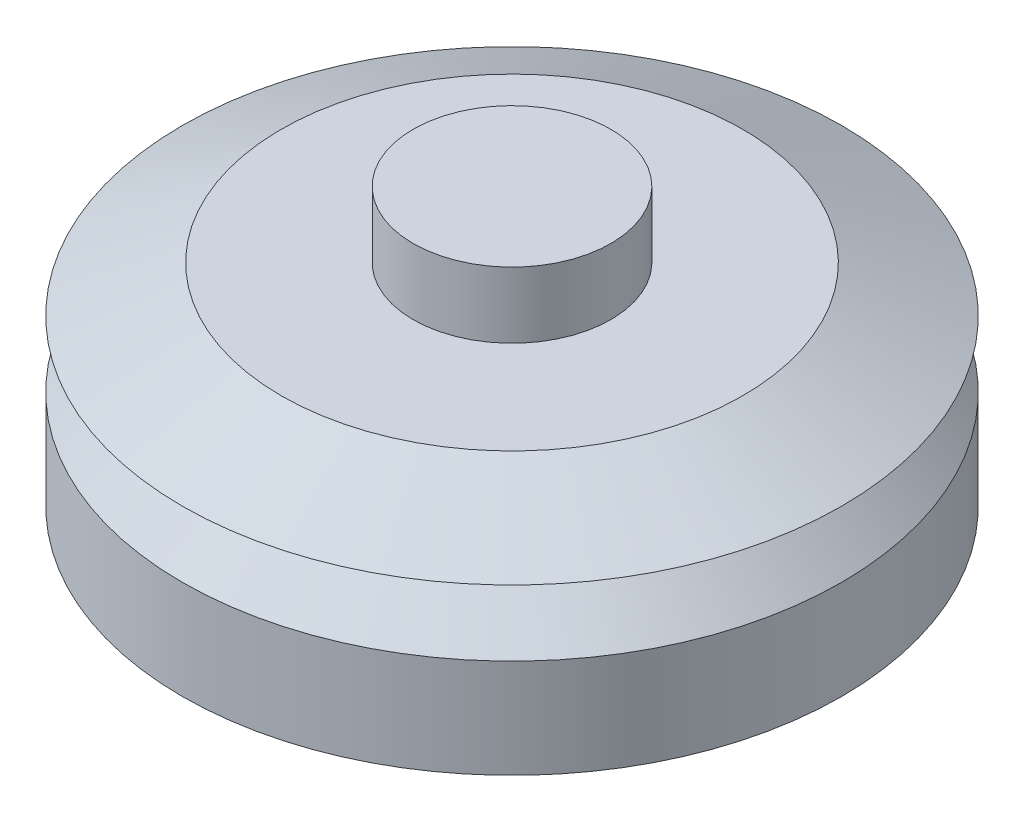
ISO-10303-21;
HEADER;
FILE_DESCRIPTION(('STEP AP214'),'2;1');
FILE_NAME('part.step','',(''),(''),'','','');
FILE_SCHEMA(('AUTOMOTIVE_DESIGN { 1 0 10303 214 1 1 1 1 }'));
ENDSEC;
DATA;
#1=APPLICATION_CONTEXT('core data for automotive mechanical design processes');
#2=APPLICATION_PROTOCOL_DEFINITION('international standard','automotive_design',2000,#1);
#3=PRODUCT_CONTEXT('',#1,'mechanical');
#4=PRODUCT('Part','Part','',(#3));
#5=PRODUCT_RELATED_PRODUCT_CATEGORY('part','',(#4));
#6=PRODUCT_DEFINITION_FORMATION('','',#4);
#7=PRODUCT_DEFINITION_CONTEXT('part definition',#1,'design');
#8=PRODUCT_DEFINITION('design','',#6,#7);
#9=PRODUCT_DEFINITION_SHAPE('','',#8);
#10=(LENGTH_UNIT() NAMED_UNIT(*) SI_UNIT(.MILLI.,.METRE.));
#11=(NAMED_UNIT(*) PLANE_ANGLE_UNIT() SI_UNIT($,.RADIAN.));
#12=(NAMED_UNIT(*) SI_UNIT($,.STERADIAN.) SOLID_ANGLE_UNIT());
#13=UNCERTAINTY_MEASURE_WITH_UNIT(LENGTH_MEASURE(1.E-05),#10,'distance_accuracy_value','');
#14=(GEOMETRIC_REPRESENTATION_CONTEXT(3) GLOBAL_UNCERTAINTY_ASSIGNED_CONTEXT((#13)) GLOBAL_UNIT_ASSIGNED_CONTEXT((#10,
#11,#12)) REPRESENTATION_CONTEXT('',''));
#15=CARTESIAN_POINT('',(0.,0.,0.));
#16=DIRECTION('',(0.,0.,1.));
#17=DIRECTION('',(1.,0.,0.));
#18=AXIS2_PLACEMENT_3D('',#15,#16,#17);
#19=CARTESIAN_POINT('',(0.,25.,0.));
#20=DIRECTION('',(0.,-1.,0.));
#21=DIRECTION('',(0.,0.,-1.));
#22=AXIS2_PLACEMENT_3D('',#19,#20,#21);
#23=CYLINDRICAL_SURFACE('',#22,50.);
#24=CARTESIAN_POINT('',(0.,15.,0.));
#25=DIRECTION('',(0.,1.,0.));
#26=DIRECTION('',(0.,0.,1.));
#27=AXIS2_PLACEMENT_3D('',#24,#25,#26);
#28=CIRCLE('',#27,50.);
#29=CARTESIAN_POINT('',(0.,15.,50.));
#30=VERTEX_POINT('',#29);
#31=EDGE_CURVE('E11',#30,#30,#28,.F.);
#32=ORIENTED_EDGE('',*,*,#31,.T.);
#33=EDGE_LOOP('',(#32));
#34=FACE_BOUND('',#33,.T.);
#35=CARTESIAN_POINT('',(0.,0.,0.));
#36=DIRECTION('',(0.,1.,0.));
#37=DIRECTION('',(0.,0.,1.));
#38=AXIS2_PLACEMENT_3D('',#35,#36,#37);
#39=CIRCLE('',#38,50.);
#40=CARTESIAN_POINT('',(0.,0.,50.));
#41=VERTEX_POINT('',#40);
#42=EDGE_CURVE('E49',#41,#41,#39,.T.);
#43=ORIENTED_EDGE('',*,*,#42,.T.);
#44=EDGE_LOOP('',(#43));
#45=FACE_BOUND('',#44,.T.);
#46=ADVANCED_FACE('F38',(#34,#45),#23,.T.);
#47=CARTESIAN_POINT('',(0.,0.,0.));
#48=DIRECTION('',(0.,1.,0.));
#49=DIRECTION('',(0.,0.,1.));
#50=AXIS2_PLACEMENT_3D('',#47,#48,#49);
#51=PLANE('',#50);
#52=ORIENTED_EDGE('',*,*,#42,.F.);
#53=EDGE_LOOP('',(#52));
#54=FACE_BOUND('',#53,.T.);
#55=ADVANCED_FACE('F81',(#54),#51,.F.);
#56=CARTESIAN_POINT('',(0.,25.,0.));
#57=DIRECTION('',(0.,-1.,0.));
#58=DIRECTION('',(0.,0.,-1.));
#59=AXIS2_PLACEMENT_3D('',#56,#57,#58);
#60=CONICAL_SURFACE('',#59,40.,0.785398163397447);
#61=ORIENTED_EDGE('',*,*,#31,.F.);
#62=EDGE_LOOP('',(#61));
#63=FACE_BOUND('',#62,.T.);
#64=CARTESIAN_POINT('',(0.,25.,0.));
#65=DIRECTION('',(0.,1.,0.));
#66=DIRECTION('',(0.,0.,1.));
#67=AXIS2_PLACEMENT_3D('',#64,#65,#66);
#68=CIRCLE('',#67,40.);
#69=CARTESIAN_POINT('',(0.,25.,40.));
#70=VERTEX_POINT('',#69);
#71=EDGE_CURVE('E45',#70,#70,#68,.T.);
#72=ORIENTED_EDGE('',*,*,#71,.F.);
#73=EDGE_LOOP('',(#72));
#74=FACE_BOUND('',#73,.T.);
#75=ADVANCED_FACE('F40',(#63,#74),#60,.T.);
#76=CARTESIAN_POINT('',(0.,32.,0.));
#77=DIRECTION('',(0.,1.,0.));
#78=DIRECTION('',(0.,0.,1.));
#79=AXIS2_PLACEMENT_3D('',#76,#77,#78);
#80=PLANE('',#79);
#81=CARTESIAN_POINT('',(0.,32.,0.));
#82=DIRECTION('',(0.,1.,0.));
#83=DIRECTION('',(0.,0.,1.));
#84=AXIS2_PLACEMENT_3D('',#81,#82,#83);
#85=CIRCLE('',#84,15.);
#86=CARTESIAN_POINT('',(0.,32.,15.));
#87=VERTEX_POINT('',#86);
#88=EDGE_CURVE('E154',#87,#87,#85,.T.);
#89=ORIENTED_EDGE('',*,*,#88,.F.);
#90=EDGE_LOOP('',(#89));
#91=FACE_BOUND('',#90,.T.);
#92=CARTESIAN_POINT('',(0.,32.,0.));
#93=DIRECTION('',(0.,1.,0.));
#94=DIRECTION('',(0.,0.,1.));
#95=AXIS2_PLACEMENT_3D('',#92,#93,#94);
#96=CIRCLE('',#95,35.);
#97=CARTESIAN_POINT('',(0.,32.,35.));
#98=VERTEX_POINT('',#97);
#99=EDGE_CURVE('E53',#98,#98,#96,.T.);
#100=ORIENTED_EDGE('',*,*,#99,.T.);
#101=EDGE_LOOP('',(#100));
#102=FACE_BOUND('',#101,.T.);
#103=ADVANCED_FACE('F66',(#91,#102),#80,.T.);
#104=CARTESIAN_POINT('',(0.,25.,0.));
#105=DIRECTION('',(0.,1.,0.));
#106=DIRECTION('',(0.,0.,1.));
#107=AXIS2_PLACEMENT_3D('',#104,#105,#106);
#108=PLANE('',#107);
#109=ORIENTED_EDGE('',*,*,#71,.T.);
#110=EDGE_LOOP('',(#109));
#111=FACE_BOUND('',#110,.T.);
#112=CARTESIAN_POINT('',(0.,25.,0.));
#113=DIRECTION('',(0.,1.,0.));
#114=DIRECTION('',(0.,0.,1.));
#115=AXIS2_PLACEMENT_3D('',#112,#113,#114);
#116=CIRCLE('',#115,50.);
#117=CARTESIAN_POINT('',(0.,25.,50.));
#118=VERTEX_POINT('',#117);
#119=EDGE_CURVE('E60',#118,#118,#116,.T.);
#120=ORIENTED_EDGE('',*,*,#119,.F.);
#121=EDGE_LOOP('',(#120));
#122=FACE_BOUND('',#121,.T.);
#123=ADVANCED_FACE('F76',(#111,#122),#108,.F.);
#124=CARTESIAN_POINT('',(0.,32.,0.));
#125=DIRECTION('',(0.,-1.,0.));
#126=DIRECTION('',(0.,0.,-1.));
#127=AXIS2_PLACEMENT_3D('',#124,#125,#126);
#128=CONICAL_SURFACE('',#127,35.,1.13416916698136);
#129=ORIENTED_EDGE('',*,*,#119,.T.);
#130=EDGE_LOOP('',(#129));
#131=FACE_BOUND('',#130,.T.);
#132=ORIENTED_EDGE('',*,*,#99,.F.);
#133=EDGE_LOOP('',(#132));
#134=FACE_BOUND('',#133,.T.);
#135=ADVANCED_FACE('F78',(#131,#134),#128,.T.);
#136=CARTESIAN_POINT('',(0.,42.,0.));
#137=DIRECTION('',(0.,-1.,0.));
#138=DIRECTION('',(0.,0.,-1.));
#139=AXIS2_PLACEMENT_3D('',#136,#137,#138);
#140=CYLINDRICAL_SURFACE('',#139,15.);
#141=CARTESIAN_POINT('',(0.,42.,0.));
#142=DIRECTION('',(0.,1.,0.));
#143=DIRECTION('',(0.,0.,1.));
#144=AXIS2_PLACEMENT_3D('',#141,#142,#143);
#145=CIRCLE('',#144,15.);
#146=CARTESIAN_POINT('',(0.,42.,15.));
#147=VERTEX_POINT('',#146);
#148=EDGE_CURVE('E153',#147,#147,#145,.T.);
#149=ORIENTED_EDGE('',*,*,#148,.F.);
#150=EDGE_LOOP('',(#149));
#151=FACE_BOUND('',#150,.T.);
#152=ORIENTED_EDGE('',*,*,#88,.T.);
#153=EDGE_LOOP('',(#152));
#154=FACE_BOUND('',#153,.T.);
#155=ADVANCED_FACE('F116',(#151,#154),#140,.T.);
#156=CARTESIAN_POINT('',(0.,42.,0.));
#157=DIRECTION('',(0.,1.,0.));
#158=DIRECTION('',(0.,0.,1.));
#159=AXIS2_PLACEMENT_3D('',#156,#157,#158);
#160=PLANE('',#159);
#161=ORIENTED_EDGE('',*,*,#148,.T.);
#162=EDGE_LOOP('',(#161));
#163=FACE_BOUND('',#162,.T.);
#164=ADVANCED_FACE('F122',(#163),#160,.T.);
#165=CLOSED_SHELL('',(#46,#55,#75,#103,#123,#135,#155,#164));
#166=MANIFOLD_SOLID_BREP('B2',#165);
#167=ADVANCED_BREP_SHAPE_REPRESENTATION('',(#18,#166),#14);
#168=SHAPE_DEFINITION_REPRESENTATION(#9,#167);
ENDSEC;
END-ISO-10303-21;
